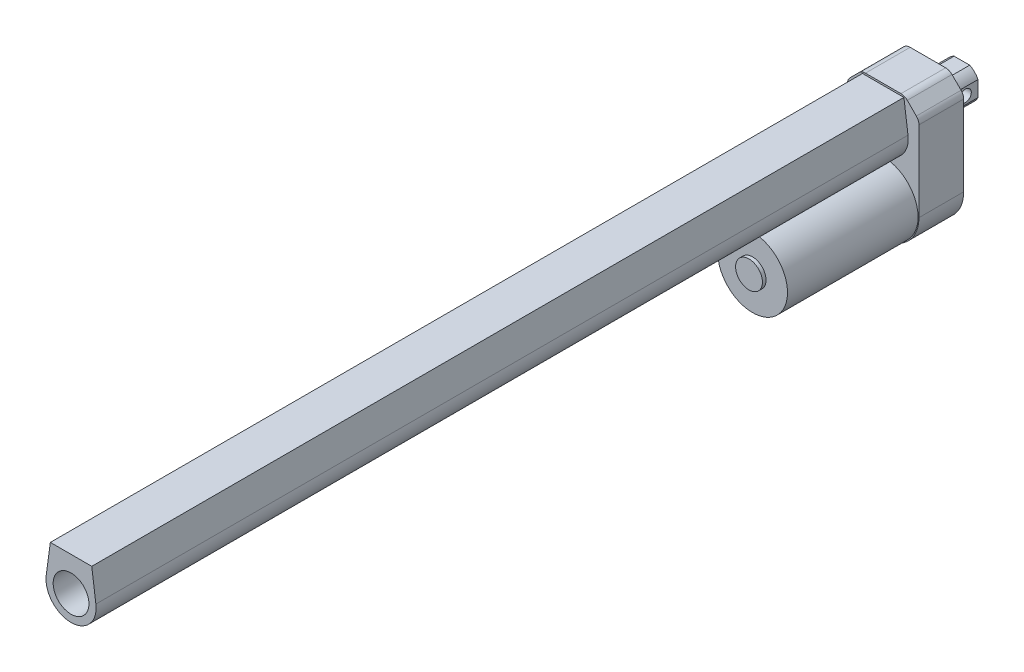
ISO-10303-21;
HEADER;
FILE_DESCRIPTION(('STEP AP214'),'2;1');
FILE_NAME('part.step','',(''),(''),'','','');
FILE_SCHEMA(('AUTOMOTIVE_DESIGN { 1 0 10303 214 1 1 1 1 }'));
ENDSEC;
DATA;
#1=APPLICATION_CONTEXT('core data for automotive mechanical design processes');
#2=APPLICATION_PROTOCOL_DEFINITION('international standard','automotive_design',2000,#1);
#3=PRODUCT_CONTEXT('',#1,'mechanical');
#4=PRODUCT('Part','Part','',(#3));
#5=PRODUCT_RELATED_PRODUCT_CATEGORY('part','',(#4));
#6=PRODUCT_DEFINITION_FORMATION('','',#4);
#7=PRODUCT_DEFINITION_CONTEXT('part definition',#1,'design');
#8=PRODUCT_DEFINITION('design','',#6,#7);
#9=PRODUCT_DEFINITION_SHAPE('','',#8);
#10=(LENGTH_UNIT() NAMED_UNIT(*) SI_UNIT(.MILLI.,.METRE.));
#11=(NAMED_UNIT(*) PLANE_ANGLE_UNIT() SI_UNIT($,.RADIAN.));
#12=(NAMED_UNIT(*) SI_UNIT($,.STERADIAN.) SOLID_ANGLE_UNIT());
#13=UNCERTAINTY_MEASURE_WITH_UNIT(LENGTH_MEASURE(1.E-05),#10,'distance_accuracy_value','');
#14=(GEOMETRIC_REPRESENTATION_CONTEXT(3) GLOBAL_UNCERTAINTY_ASSIGNED_CONTEXT((#13)) GLOBAL_UNIT_ASSIGNED_CONTEXT((#10,
#11,#12)) REPRESENTATION_CONTEXT('',''));
#15=CARTESIAN_POINT('',(0.,0.,0.));
#16=DIRECTION('',(0.,0.,1.));
#17=DIRECTION('',(1.,0.,0.));
#18=AXIS2_PLACEMENT_3D('',#15,#16,#17);
#19=CARTESIAN_POINT('',(0.,0.,0.));
#20=DIRECTION('',(0.,0.,1.));
#21=DIRECTION('',(1.,0.,0.));
#22=AXIS2_PLACEMENT_3D('',#19,#20,#21);
#23=PLANE('',#22);
#24=CARTESIAN_POINT('',(0.,0.,0.));
#25=DIRECTION('',(0.,0.,1.));
#26=DIRECTION('',(1.,0.,0.));
#27=AXIS2_PLACEMENT_3D('',#24,#25,#26);
#28=CIRCLE('',#27,20.);
#29=CARTESIAN_POINT('',(-20.,0.,0.));
#30=VERTEX_POINT('',#29);
#31=CARTESIAN_POINT('',(20.,0.,0.));
#32=VERTEX_POINT('',#31);
#33=EDGE_CURVE('E252',#30,#32,#28,.T.);
#34=ORIENTED_EDGE('',*,*,#33,.F.);
#35=DIRECTION('',(0.,-1.,0.));
#36=VECTOR('',#35,1.);
#37=CARTESIAN_POINT('',(-20.,0.,0.));
#38=LINE('',#37,#36);
#39=CARTESIAN_POINT('',(-20.,44.9289321881345,0.));
#40=VERTEX_POINT('',#39);
#41=EDGE_CURVE('E259',#40,#30,#38,.T.);
#42=ORIENTED_EDGE('',*,*,#41,.F.);
#43=CARTESIAN_POINT('',(-15.,44.9289321881345,0.));
#44=DIRECTION('',(0.,0.,1.));
#45=DIRECTION('',(-1.,0.,0.));
#46=AXIS2_PLACEMENT_3D('',#43,#44,#45);
#47=CIRCLE('',#46,5.);
#48=CARTESIAN_POINT('',(-18.5355339059327,48.4644660940673,0.));
#49=VERTEX_POINT('',#48);
#50=EDGE_CURVE('E294',#49,#40,#47,.T.);
#51=ORIENTED_EDGE('',*,*,#50,.F.);
#52=DIRECTION('',(-0.707106781186547,-0.707106781186548,0.));
#53=VECTOR('',#52,1.);
#54=CARTESIAN_POINT('',(-18.5355339059327,48.4644660940673,0.));
#55=LINE('',#54,#53);
#56=CARTESIAN_POINT('',(-13.4644660940673,53.5355339059327,0.));
#57=VERTEX_POINT('',#56);
#58=EDGE_CURVE('E292',#57,#49,#55,.T.);
#59=ORIENTED_EDGE('',*,*,#58,.F.);
#60=CARTESIAN_POINT('',(-9.92893218813452,50.,0.));
#61=DIRECTION('',(0.,0.,1.));
#62=DIRECTION('',(-1.,0.,0.));
#63=AXIS2_PLACEMENT_3D('',#60,#61,#62);
#64=CIRCLE('',#63,5.);
#65=CARTESIAN_POINT('',(-9.92893218813452,55.,0.));
#66=VERTEX_POINT('',#65);
#67=EDGE_CURVE('E290',#66,#57,#64,.T.);
#68=ORIENTED_EDGE('',*,*,#67,.F.);
#69=DIRECTION('',(-1.,0.,0.));
#70=VECTOR('',#69,1.);
#71=CARTESIAN_POINT('',(-9.92893218813452,55.,0.));
#72=LINE('',#71,#70);
#73=CARTESIAN_POINT('',(9.92893218813453,55.,0.));
#74=VERTEX_POINT('',#73);
#75=EDGE_CURVE('E288',#74,#66,#72,.T.);
#76=ORIENTED_EDGE('',*,*,#75,.F.);
#77=CARTESIAN_POINT('',(9.92893218813453,50.,0.));
#78=DIRECTION('',(0.,0.,1.));
#79=DIRECTION('',(1.,0.,0.));
#80=AXIS2_PLACEMENT_3D('',#77,#78,#79);
#81=CIRCLE('',#80,5.);
#82=CARTESIAN_POINT('',(13.4644660940673,53.5355339059327,0.));
#83=VERTEX_POINT('',#82);
#84=EDGE_CURVE('E286',#83,#74,#81,.T.);
#85=ORIENTED_EDGE('',*,*,#84,.F.);
#86=DIRECTION('',(-0.707106781186547,0.707106781186548,0.));
#87=VECTOR('',#86,1.);
#88=CARTESIAN_POINT('',(13.4644660940673,53.5355339059327,0.));
#89=LINE('',#88,#87);
#90=CARTESIAN_POINT('',(18.5355339059327,48.4644660940673,0.));
#91=VERTEX_POINT('',#90);
#92=EDGE_CURVE('E284',#91,#83,#89,.T.);
#93=ORIENTED_EDGE('',*,*,#92,.F.);
#94=CARTESIAN_POINT('',(15.,44.9289321881345,0.));
#95=DIRECTION('',(0.,0.,1.));
#96=DIRECTION('',(1.,0.,0.));
#97=AXIS2_PLACEMENT_3D('',#94,#95,#96);
#98=CIRCLE('',#97,5.);
#99=CARTESIAN_POINT('',(20.,44.9289321881345,0.));
#100=VERTEX_POINT('',#99);
#101=EDGE_CURVE('E282',#100,#91,#98,.T.);
#102=ORIENTED_EDGE('',*,*,#101,.F.);
#103=DIRECTION('',(0.,1.,0.));
#104=VECTOR('',#103,1.);
#105=CARTESIAN_POINT('',(20.,44.9289321881345,0.));
#106=LINE('',#105,#104);
#107=EDGE_CURVE('E280',#32,#100,#106,.T.);
#108=ORIENTED_EDGE('',*,*,#107,.F.);
#109=EDGE_LOOP('',(#34,#42,#51,#59,#68,#76,#85,#93,#102,#108));
#110=FACE_BOUND('',#109,.T.);
#111=CARTESIAN_POINT('',(0.,35.,0.));
#112=DIRECTION('',(0.,0.,-1.));
#113=DIRECTION('',(-1.,0.,0.));
#114=AXIS2_PLACEMENT_3D('',#111,#112,#113);
#115=CIRCLE('',#114,10.);
#116=CARTESIAN_POINT('',(9.00000000000001,30.6411010564594,0.));
#117=VERTEX_POINT('',#116);
#118=CARTESIAN_POINT('',(4.35889894354065,26.,0.));
#119=VERTEX_POINT('',#118);
#120=EDGE_CURVE('E205',#117,#119,#115,.T.);
#121=ORIENTED_EDGE('',*,*,#120,.F.);
#122=DIRECTION('',(0.,-1.,0.));
#123=VECTOR('',#122,1.);
#124=CARTESIAN_POINT('',(9.00000000000001,39.3588989435407,0.));
#125=LINE('',#124,#123);
#126=CARTESIAN_POINT('',(9.00000000000001,39.3588989435407,0.));
#127=VERTEX_POINT('',#126);
#128=EDGE_CURVE('E202',#127,#117,#125,.T.);
#129=ORIENTED_EDGE('',*,*,#128,.F.);
#130=CARTESIAN_POINT('',(0.,35.,0.));
#131=DIRECTION('',(0.,0.,-1.));
#132=DIRECTION('',(-1.,0.,0.));
#133=AXIS2_PLACEMENT_3D('',#130,#131,#132);
#134=CIRCLE('',#133,10.);
#135=CARTESIAN_POINT('',(4.3588989435407,44.,0.));
#136=VERTEX_POINT('',#135);
#137=EDGE_CURVE('E705',#136,#127,#134,.T.);
#138=ORIENTED_EDGE('',*,*,#137,.F.);
#139=DIRECTION('',(1.,0.,0.));
#140=VECTOR('',#139,1.);
#141=CARTESIAN_POINT('',(4.3588989435407,44.,0.));
#142=LINE('',#141,#140);
#143=CARTESIAN_POINT('',(-4.3588989435407,44.,0.));
#144=VERTEX_POINT('',#143);
#145=EDGE_CURVE('E702',#144,#136,#142,.T.);
#146=ORIENTED_EDGE('',*,*,#145,.F.);
#147=CARTESIAN_POINT('',(0.,35.,0.));
#148=DIRECTION('',(0.,0.,-1.));
#149=DIRECTION('',(-1.,0.,0.));
#150=AXIS2_PLACEMENT_3D('',#147,#148,#149);
#151=CIRCLE('',#150,10.);
#152=CARTESIAN_POINT('',(-9.,39.3588989435407,0.));
#153=VERTEX_POINT('',#152);
#154=EDGE_CURVE('E699',#153,#144,#151,.T.);
#155=ORIENTED_EDGE('',*,*,#154,.F.);
#156=DIRECTION('',(0.,1.,0.));
#157=VECTOR('',#156,1.);
#158=CARTESIAN_POINT('',(-9.,39.3588989435407,0.));
#159=LINE('',#158,#157);
#160=CARTESIAN_POINT('',(-9.00000000000001,30.6411010564594,0.));
#161=VERTEX_POINT('',#160);
#162=EDGE_CURVE('E696',#161,#153,#159,.T.);
#163=ORIENTED_EDGE('',*,*,#162,.F.);
#164=CARTESIAN_POINT('',(0.,35.,0.));
#165=DIRECTION('',(0.,0.,-1.));
#166=DIRECTION('',(-1.,0.,0.));
#167=AXIS2_PLACEMENT_3D('',#164,#165,#166);
#168=CIRCLE('',#167,10.);
#169=CARTESIAN_POINT('',(-4.35889894354066,26.,0.));
#170=VERTEX_POINT('',#169);
#171=EDGE_CURVE('E56',#170,#161,#168,.T.);
#172=ORIENTED_EDGE('',*,*,#171,.F.);
#173=DIRECTION('',(-1.,0.,0.));
#174=VECTOR('',#173,1.);
#175=CARTESIAN_POINT('',(4.35889894354065,26.,0.));
#176=LINE('',#175,#174);
#177=EDGE_CURVE('E51',#119,#170,#176,.T.);
#178=ORIENTED_EDGE('',*,*,#177,.F.);
#179=EDGE_LOOP('',(#121,#129,#138,#146,#155,#163,#172,#178));
#180=FACE_BOUND('',#179,.T.);
#181=ADVANCED_FACE('F34',(#110,#180),#23,.F.);
#182=CARTESIAN_POINT('',(0.,0.,25.));
#183=DIRECTION('',(0.,0.,1.));
#184=DIRECTION('',(1.,0.,0.));
#185=AXIS2_PLACEMENT_3D('',#182,#183,#184);
#186=PLANE('',#185);
#187=CARTESIAN_POINT('',(0.,0.,25.));
#188=DIRECTION('',(0.,0.,1.));
#189=DIRECTION('',(1.,0.,0.));
#190=AXIS2_PLACEMENT_3D('',#187,#188,#189);
#191=CIRCLE('',#190,19.5);
#192=CARTESIAN_POINT('',(19.5,0.,25.));
#193=VERTEX_POINT('',#192);
#194=EDGE_CURVE('E43',#193,#193,#191,.T.);
#195=ORIENTED_EDGE('',*,*,#194,.F.);
#196=EDGE_LOOP('',(#195));
#197=FACE_BOUND('',#196,.T.);
#198=CARTESIAN_POINT('',(0.,0.,25.));
#199=DIRECTION('',(0.,0.,1.));
#200=DIRECTION('',(1.,0.,0.));
#201=AXIS2_PLACEMENT_3D('',#198,#199,#200);
#202=CIRCLE('',#201,20.);
#203=CARTESIAN_POINT('',(-20.,0.,25.));
#204=VERTEX_POINT('',#203);
#205=CARTESIAN_POINT('',(20.,0.,25.));
#206=VERTEX_POINT('',#205);
#207=EDGE_CURVE('E255',#204,#206,#202,.T.);
#208=ORIENTED_EDGE('',*,*,#207,.T.);
#209=DIRECTION('',(0.,1.,0.));
#210=VECTOR('',#209,1.);
#211=CARTESIAN_POINT('',(20.,44.9289321881345,25.));
#212=LINE('',#211,#210);
#213=CARTESIAN_POINT('',(20.,44.9289321881345,25.));
#214=VERTEX_POINT('',#213);
#215=EDGE_CURVE('E258',#206,#214,#212,.T.);
#216=ORIENTED_EDGE('',*,*,#215,.T.);
#217=CARTESIAN_POINT('',(15.,44.9289321881345,25.));
#218=DIRECTION('',(0.,0.,1.));
#219=DIRECTION('',(1.,0.,0.));
#220=AXIS2_PLACEMENT_3D('',#217,#218,#219);
#221=CIRCLE('',#220,5.);
#222=CARTESIAN_POINT('',(18.5355339059327,48.4644660940673,25.));
#223=VERTEX_POINT('',#222);
#224=EDGE_CURVE('E261',#214,#223,#221,.T.);
#225=ORIENTED_EDGE('',*,*,#224,.T.);
#226=DIRECTION('',(-0.707106781186547,0.707106781186548,0.));
#227=VECTOR('',#226,1.);
#228=CARTESIAN_POINT('',(13.4644660940673,53.5355339059327,25.));
#229=LINE('',#228,#227);
#230=CARTESIAN_POINT('',(13.4644660940673,53.5355339059327,25.));
#231=VERTEX_POINT('',#230);
#232=EDGE_CURVE('E263',#223,#231,#229,.T.);
#233=ORIENTED_EDGE('',*,*,#232,.T.);
#234=CARTESIAN_POINT('',(9.92893218813453,50.,25.));
#235=DIRECTION('',(0.,0.,1.));
#236=DIRECTION('',(1.,0.,0.));
#237=AXIS2_PLACEMENT_3D('',#234,#235,#236);
#238=CIRCLE('',#237,5.);
#239=CARTESIAN_POINT('',(9.92893218813453,55.,25.));
#240=VERTEX_POINT('',#239);
#241=EDGE_CURVE('E265',#231,#240,#238,.T.);
#242=ORIENTED_EDGE('',*,*,#241,.T.);
#243=DIRECTION('',(-1.,0.,0.));
#244=VECTOR('',#243,1.);
#245=CARTESIAN_POINT('',(-9.92893218813452,55.,25.));
#246=LINE('',#245,#244);
#247=CARTESIAN_POINT('',(-9.92893218813452,55.,25.));
#248=VERTEX_POINT('',#247);
#249=EDGE_CURVE('E267',#240,#248,#246,.T.);
#250=ORIENTED_EDGE('',*,*,#249,.T.);
#251=CARTESIAN_POINT('',(-9.92893218813452,50.,25.));
#252=DIRECTION('',(0.,0.,1.));
#253=DIRECTION('',(-1.,0.,0.));
#254=AXIS2_PLACEMENT_3D('',#251,#252,#253);
#255=CIRCLE('',#254,5.);
#256=CARTESIAN_POINT('',(-13.4644660940673,53.5355339059327,25.));
#257=VERTEX_POINT('',#256);
#258=EDGE_CURVE('E269',#248,#257,#255,.T.);
#259=ORIENTED_EDGE('',*,*,#258,.T.);
#260=DIRECTION('',(-0.707106781186547,-0.707106781186548,0.));
#261=VECTOR('',#260,1.);
#262=CARTESIAN_POINT('',(-18.5355339059327,48.4644660940673,25.));
#263=LINE('',#262,#261);
#264=CARTESIAN_POINT('',(-18.5355339059327,48.4644660940673,25.));
#265=VERTEX_POINT('',#264);
#266=EDGE_CURVE('E271',#257,#265,#263,.T.);
#267=ORIENTED_EDGE('',*,*,#266,.T.);
#268=CARTESIAN_POINT('',(-15.,44.9289321881345,25.));
#269=DIRECTION('',(0.,0.,1.));
#270=DIRECTION('',(-1.,0.,0.));
#271=AXIS2_PLACEMENT_3D('',#268,#269,#270);
#272=CIRCLE('',#271,5.);
#273=CARTESIAN_POINT('',(-20.,44.9289321881345,25.));
#274=VERTEX_POINT('',#273);
#275=EDGE_CURVE('E273',#265,#274,#272,.T.);
#276=ORIENTED_EDGE('',*,*,#275,.T.);
#277=DIRECTION('',(0.,-1.,0.));
#278=VECTOR('',#277,1.);
#279=CARTESIAN_POINT('',(-20.,0.,25.));
#280=LINE('',#279,#278);
#281=EDGE_CURVE('E275',#274,#204,#280,.T.);
#282=ORIENTED_EDGE('',*,*,#281,.T.);
#283=EDGE_LOOP('',(#208,#216,#225,#233,#242,#250,#259,#267,#276,#282));
#284=FACE_BOUND('',#283,.T.);
#285=DIRECTION('',(-0.13296122052609,-0.991121240735064,0.));
#286=VECTOR('',#285,1.);
#287=CARTESIAN_POINT('',(-11.5765219616268,54.,25.));
#288=LINE('',#287,#286);
#289=CARTESIAN_POINT('',(-11.5765219616268,54.,25.));
#290=VERTEX_POINT('',#289);
#291=CARTESIAN_POINT('',(-13.8756973702909,36.8614570873653,25.));
#292=VERTEX_POINT('',#291);
#293=EDGE_CURVE('E231',#290,#292,#288,.T.);
#294=ORIENTED_EDGE('',*,*,#293,.F.);
#295=DIRECTION('',(-1.,0.,0.));
#296=VECTOR('',#295,1.);
#297=CARTESIAN_POINT('',(-11.5765219616268,54.,25.));
#298=LINE('',#297,#296);
#299=CARTESIAN_POINT('',(11.5765219616268,54.,25.));
#300=VERTEX_POINT('',#299);
#301=EDGE_CURVE('E216',#300,#290,#298,.T.);
#302=ORIENTED_EDGE('',*,*,#301,.F.);
#303=DIRECTION('',(-0.13296122052609,0.991121240735064,0.));
#304=VECTOR('',#303,1.);
#305=CARTESIAN_POINT('',(11.5765219616268,54.,25.));
#306=LINE('',#305,#304);
#307=CARTESIAN_POINT('',(13.8756973702909,36.8614570873653,25.));
#308=VERTEX_POINT('',#307);
#309=EDGE_CURVE('E222',#308,#300,#306,.T.);
#310=ORIENTED_EDGE('',*,*,#309,.F.);
#311=CARTESIAN_POINT('',(0.,35.,25.));
#312=DIRECTION('',(0.,0.,1.));
#313=DIRECTION('',(1.,0.,0.));
#314=AXIS2_PLACEMENT_3D('',#311,#312,#313);
#315=CIRCLE('',#314,14.);
#316=EDGE_CURVE('E233',#292,#308,#315,.T.);
#317=ORIENTED_EDGE('',*,*,#316,.F.);
#318=EDGE_LOOP('',(#294,#302,#310,#317));
#319=FACE_BOUND('',#318,.T.);
#320=ADVANCED_FACE('F346',(#197,#284,#319),#186,.T.);
#321=CARTESIAN_POINT('',(0.,0.,25.));
#322=DIRECTION('',(0.,0.,-1.));
#323=DIRECTION('',(-1.,0.,0.));
#324=AXIS2_PLACEMENT_3D('',#321,#322,#323);
#325=CYLINDRICAL_SURFACE('',#324,20.);
#326=ORIENTED_EDGE('',*,*,#33,.T.);
#327=DIRECTION('',(0.,0.,-1.));
#328=VECTOR('',#327,1.);
#329=CARTESIAN_POINT('',(20.,0.,25.));
#330=LINE('',#329,#328);
#331=EDGE_CURVE('E38',#206,#32,#330,.T.);
#332=ORIENTED_EDGE('',*,*,#331,.F.);
#333=ORIENTED_EDGE('',*,*,#207,.F.);
#334=DIRECTION('',(0.,0.,-1.));
#335=VECTOR('',#334,1.);
#336=CARTESIAN_POINT('',(-20.,0.,25.));
#337=LINE('',#336,#335);
#338=EDGE_CURVE('E277',#204,#30,#337,.T.);
#339=ORIENTED_EDGE('',*,*,#338,.T.);
#340=EDGE_LOOP('',(#326,#332,#333,#339));
#341=FACE_BOUND('',#340,.T.);
#342=ADVANCED_FACE('F36',(#341),#325,.T.);
#343=CARTESIAN_POINT('',(20.,44.9289321881345,25.));
#344=DIRECTION('',(-1.,0.,0.));
#345=DIRECTION('',(0.,-1.,0.));
#346=AXIS2_PLACEMENT_3D('',#343,#344,#345);
#347=PLANE('',#346);
#348=ORIENTED_EDGE('',*,*,#107,.T.);
#349=DIRECTION('',(0.,0.,-1.));
#350=VECTOR('',#349,1.);
#351=CARTESIAN_POINT('',(20.,44.9289321881345,25.));
#352=LINE('',#351,#350);
#353=EDGE_CURVE('E319',#214,#100,#352,.T.);
#354=ORIENTED_EDGE('',*,*,#353,.F.);
#355=ORIENTED_EDGE('',*,*,#215,.F.);
#356=ORIENTED_EDGE('',*,*,#331,.T.);
#357=EDGE_LOOP('',(#348,#354,#355,#356));
#358=FACE_BOUND('',#357,.T.);
#359=ADVANCED_FACE('F328',(#358),#347,.F.);
#360=CARTESIAN_POINT('',(15.,44.9289321881345,25.));
#361=DIRECTION('',(0.,0.,-1.));
#362=DIRECTION('',(-1.,0.,0.));
#363=AXIS2_PLACEMENT_3D('',#360,#361,#362);
#364=CYLINDRICAL_SURFACE('',#363,5.);
#365=ORIENTED_EDGE('',*,*,#101,.T.);
#366=DIRECTION('',(0.,0.,-1.));
#367=VECTOR('',#366,1.);
#368=CARTESIAN_POINT('',(18.5355339059327,48.4644660940673,25.));
#369=LINE('',#368,#367);
#370=EDGE_CURVE('E317',#223,#91,#369,.T.);
#371=ORIENTED_EDGE('',*,*,#370,.F.);
#372=ORIENTED_EDGE('',*,*,#224,.F.);
#373=ORIENTED_EDGE('',*,*,#353,.T.);
#374=EDGE_LOOP('',(#365,#371,#372,#373));
#375=FACE_BOUND('',#374,.T.);
#376=ADVANCED_FACE('F339',(#375),#364,.T.);
#377=CARTESIAN_POINT('',(13.4644660940673,53.5355339059327,25.));
#378=DIRECTION('',(-0.707106781186548,-0.707106781186547,0.));
#379=DIRECTION('',(0.707106781186547,-0.707106781186548,0.));
#380=AXIS2_PLACEMENT_3D('',#377,#378,#379);
#381=PLANE('',#380);
#382=ORIENTED_EDGE('',*,*,#92,.T.);
#383=DIRECTION('',(0.,0.,-1.));
#384=VECTOR('',#383,1.);
#385=CARTESIAN_POINT('',(13.4644660940673,53.5355339059327,25.));
#386=LINE('',#385,#384);
#387=EDGE_CURVE('E314',#231,#83,#386,.T.);
#388=ORIENTED_EDGE('',*,*,#387,.F.);
#389=ORIENTED_EDGE('',*,*,#232,.F.);
#390=ORIENTED_EDGE('',*,*,#370,.T.);
#391=EDGE_LOOP('',(#382,#388,#389,#390));
#392=FACE_BOUND('',#391,.T.);
#393=ADVANCED_FACE('F342',(#392),#381,.F.);
#394=CARTESIAN_POINT('',(9.92893218813453,50.,25.));
#395=DIRECTION('',(0.,0.,-1.));
#396=DIRECTION('',(-1.,0.,0.));
#397=AXIS2_PLACEMENT_3D('',#394,#395,#396);
#398=CYLINDRICAL_SURFACE('',#397,5.);
#399=ORIENTED_EDGE('',*,*,#84,.T.);
#400=DIRECTION('',(0.,0.,-1.));
#401=VECTOR('',#400,1.);
#402=CARTESIAN_POINT('',(9.92893218813453,55.,25.));
#403=LINE('',#402,#401);
#404=EDGE_CURVE('E311',#240,#74,#403,.T.);
#405=ORIENTED_EDGE('',*,*,#404,.F.);
#406=ORIENTED_EDGE('',*,*,#241,.F.);
#407=ORIENTED_EDGE('',*,*,#387,.T.);
#408=EDGE_LOOP('',(#399,#405,#406,#407));
#409=FACE_BOUND('',#408,.T.);
#410=ADVANCED_FACE('F372',(#409),#398,.T.);
#411=CARTESIAN_POINT('',(-9.92893218813452,55.,25.));
#412=DIRECTION('',(0.,-1.,0.));
#413=DIRECTION('',(0.,0.,-1.));
#414=AXIS2_PLACEMENT_3D('',#411,#412,#413);
#415=PLANE('',#414);
#416=ORIENTED_EDGE('',*,*,#75,.T.);
#417=DIRECTION('',(0.,0.,-1.));
#418=VECTOR('',#417,1.);
#419=CARTESIAN_POINT('',(-9.92893218813452,55.,25.));
#420=LINE('',#419,#418);
#421=EDGE_CURVE('E308',#248,#66,#420,.T.);
#422=ORIENTED_EDGE('',*,*,#421,.F.);
#423=ORIENTED_EDGE('',*,*,#249,.F.);
#424=ORIENTED_EDGE('',*,*,#404,.T.);
#425=EDGE_LOOP('',(#416,#422,#423,#424));
#426=FACE_BOUND('',#425,.T.);
#427=ADVANCED_FACE('F370',(#426),#415,.F.);
#428=CARTESIAN_POINT('',(-9.92893218813452,50.,25.));
#429=DIRECTION('',(0.,0.,-1.));
#430=DIRECTION('',(-1.,0.,0.));
#431=AXIS2_PLACEMENT_3D('',#428,#429,#430);
#432=CYLINDRICAL_SURFACE('',#431,5.);
#433=ORIENTED_EDGE('',*,*,#67,.T.);
#434=DIRECTION('',(0.,0.,-1.));
#435=VECTOR('',#434,1.);
#436=CARTESIAN_POINT('',(-13.4644660940673,53.5355339059327,25.));
#437=LINE('',#436,#435);
#438=EDGE_CURVE('E305',#257,#57,#437,.T.);
#439=ORIENTED_EDGE('',*,*,#438,.F.);
#440=ORIENTED_EDGE('',*,*,#258,.F.);
#441=ORIENTED_EDGE('',*,*,#421,.T.);
#442=EDGE_LOOP('',(#433,#439,#440,#441));
#443=FACE_BOUND('',#442,.T.);
#444=ADVANCED_FACE('F366',(#443),#432,.T.);
#445=CARTESIAN_POINT('',(-18.5355339059327,48.4644660940673,25.));
#446=DIRECTION('',(0.707106781186548,-0.707106781186547,0.));
#447=DIRECTION('',(0.707106781186547,0.707106781186548,0.));
#448=AXIS2_PLACEMENT_3D('',#445,#446,#447);
#449=PLANE('',#448);
#450=ORIENTED_EDGE('',*,*,#58,.T.);
#451=DIRECTION('',(0.,0.,-1.));
#452=VECTOR('',#451,1.);
#453=CARTESIAN_POINT('',(-18.5355339059327,48.4644660940673,25.));
#454=LINE('',#453,#452);
#455=EDGE_CURVE('E302',#265,#49,#454,.T.);
#456=ORIENTED_EDGE('',*,*,#455,.F.);
#457=ORIENTED_EDGE('',*,*,#266,.F.);
#458=ORIENTED_EDGE('',*,*,#438,.T.);
#459=EDGE_LOOP('',(#450,#456,#457,#458));
#460=FACE_BOUND('',#459,.T.);
#461=ADVANCED_FACE('F361',(#460),#449,.F.);
#462=CARTESIAN_POINT('',(-15.,44.9289321881345,25.));
#463=DIRECTION('',(0.,0.,-1.));
#464=DIRECTION('',(-1.,0.,0.));
#465=AXIS2_PLACEMENT_3D('',#462,#463,#464);
#466=CYLINDRICAL_SURFACE('',#465,5.);
#467=ORIENTED_EDGE('',*,*,#50,.T.);
#468=DIRECTION('',(0.,0.,-1.));
#469=VECTOR('',#468,1.);
#470=CARTESIAN_POINT('',(-20.,44.9289321881345,25.));
#471=LINE('',#470,#469);
#472=EDGE_CURVE('E299',#274,#40,#471,.T.);
#473=ORIENTED_EDGE('',*,*,#472,.F.);
#474=ORIENTED_EDGE('',*,*,#275,.F.);
#475=ORIENTED_EDGE('',*,*,#455,.T.);
#476=EDGE_LOOP('',(#467,#473,#474,#475));
#477=FACE_BOUND('',#476,.T.);
#478=ADVANCED_FACE('F355',(#477),#466,.T.);
#479=CARTESIAN_POINT('',(-20.,0.,25.));
#480=DIRECTION('',(1.,0.,0.));
#481=DIRECTION('',(0.,0.,-1.));
#482=AXIS2_PLACEMENT_3D('',#479,#480,#481);
#483=PLANE('',#482);
#484=ORIENTED_EDGE('',*,*,#41,.T.);
#485=ORIENTED_EDGE('',*,*,#338,.F.);
#486=ORIENTED_EDGE('',*,*,#281,.F.);
#487=ORIENTED_EDGE('',*,*,#472,.T.);
#488=EDGE_LOOP('',(#484,#485,#486,#487));
#489=FACE_BOUND('',#488,.T.);
#490=ADVANCED_FACE('F353',(#489),#483,.F.);
#491=CARTESIAN_POINT('',(0.,0.,98.));
#492=DIRECTION('',(0.,0.,-1.));
#493=DIRECTION('',(-1.,0.,0.));
#494=AXIS2_PLACEMENT_3D('',#491,#492,#493);
#495=CYLINDRICAL_SURFACE('',#494,19.5);
#496=CARTESIAN_POINT('',(0.,0.,98.));
#497=DIRECTION('',(0.,0.,1.));
#498=DIRECTION('',(1.,0.,0.));
#499=AXIS2_PLACEMENT_3D('',#496,#497,#498);
#500=CIRCLE('',#499,19.5);
#501=CARTESIAN_POINT('',(19.5,0.,98.));
#502=VERTEX_POINT('',#501);
#503=EDGE_CURVE('E248',#502,#502,#500,.T.);
#504=ORIENTED_EDGE('',*,*,#503,.F.);
#505=EDGE_LOOP('',(#504));
#506=FACE_BOUND('',#505,.T.);
#507=ORIENTED_EDGE('',*,*,#194,.T.);
#508=EDGE_LOOP('',(#507));
#509=FACE_BOUND('',#508,.T.);
#510=ADVANCED_FACE('F392',(#506,#509),#495,.T.);
#511=CARTESIAN_POINT('',(0.,0.,98.));
#512=DIRECTION('',(0.,0.,1.));
#513=DIRECTION('',(1.,0.,0.));
#514=AXIS2_PLACEMENT_3D('',#511,#512,#513);
#515=PLANE('',#514);
#516=CARTESIAN_POINT('',(0.,0.,98.));
#517=DIRECTION('',(0.,0.,1.));
#518=DIRECTION('',(1.,0.,0.));
#519=AXIS2_PLACEMENT_3D('',#516,#517,#518);
#520=CIRCLE('',#519,7.5);
#521=CARTESIAN_POINT('',(7.5,0.,98.));
#522=VERTEX_POINT('',#521);
#523=EDGE_CURVE('E11',#522,#522,#520,.T.);
#524=ORIENTED_EDGE('',*,*,#523,.F.);
#525=EDGE_LOOP('',(#524));
#526=FACE_BOUND('',#525,.T.);
#527=ORIENTED_EDGE('',*,*,#503,.T.);
#528=EDGE_LOOP('',(#527));
#529=FACE_BOUND('',#528,.T.);
#530=ADVANCED_FACE('F420',(#526,#529),#515,.T.);
#531=CARTESIAN_POINT('',(0.,0.,100.));
#532=DIRECTION('',(0.,0.,-1.));
#533=DIRECTION('',(-1.,0.,0.));
#534=AXIS2_PLACEMENT_3D('',#531,#532,#533);
#535=CYLINDRICAL_SURFACE('',#534,7.5);
#536=CARTESIAN_POINT('',(0.,0.,100.));
#537=DIRECTION('',(0.,0.,1.));
#538=DIRECTION('',(1.,0.,0.));
#539=AXIS2_PLACEMENT_3D('',#536,#537,#538);
#540=CIRCLE('',#539,7.5);
#541=CARTESIAN_POINT('',(7.5,0.,100.));
#542=VERTEX_POINT('',#541);
#543=EDGE_CURVE('E246',#542,#542,#540,.T.);
#544=ORIENTED_EDGE('',*,*,#543,.F.);
#545=EDGE_LOOP('',(#544));
#546=FACE_BOUND('',#545,.T.);
#547=ORIENTED_EDGE('',*,*,#523,.T.);
#548=EDGE_LOOP('',(#547));
#549=FACE_BOUND('',#548,.T.);
#550=ADVANCED_FACE('F427',(#546,#549),#535,.T.);
#551=CARTESIAN_POINT('',(0.,0.,100.));
#552=DIRECTION('',(0.,0.,1.));
#553=DIRECTION('',(1.,0.,0.));
#554=AXIS2_PLACEMENT_3D('',#551,#552,#553);
#555=PLANE('',#554);
#556=ORIENTED_EDGE('',*,*,#543,.T.);
#557=EDGE_LOOP('',(#556));
#558=FACE_BOUND('',#557,.T.);
#559=ADVANCED_FACE('F435',(#558),#555,.T.);
#560=CARTESIAN_POINT('',(-11.5765219616268,54.,479.));
#561=DIRECTION('',(0.,-1.,0.));
#562=DIRECTION('',(0.,0.,-1.));
#563=AXIS2_PLACEMENT_3D('',#560,#561,#562);
#564=PLANE('',#563);
#565=ORIENTED_EDGE('',*,*,#301,.T.);
#566=DIRECTION('',(0.,0.,-1.));
#567=VECTOR('',#566,1.);
#568=CARTESIAN_POINT('',(-11.5765219616268,54.,479.));
#569=LINE('',#568,#567);
#570=CARTESIAN_POINT('',(-11.5765219616268,54.,479.));
#571=VERTEX_POINT('',#570);
#572=EDGE_CURVE('E244',#571,#290,#569,.T.);
#573=ORIENTED_EDGE('',*,*,#572,.F.);
#574=DIRECTION('',(-1.,0.,0.));
#575=VECTOR('',#574,1.);
#576=CARTESIAN_POINT('',(-11.5765219616268,54.,479.));
#577=LINE('',#576,#575);
#578=CARTESIAN_POINT('',(11.5765219616268,54.,479.));
#579=VERTEX_POINT('',#578);
#580=EDGE_CURVE('E218',#579,#571,#577,.T.);
#581=ORIENTED_EDGE('',*,*,#580,.F.);
#582=DIRECTION('',(0.,0.,-1.));
#583=VECTOR('',#582,1.);
#584=CARTESIAN_POINT('',(11.5765219616268,54.,479.));
#585=LINE('',#584,#583);
#586=EDGE_CURVE('E228',#579,#300,#585,.T.);
#587=ORIENTED_EDGE('',*,*,#586,.T.);
#588=EDGE_LOOP('',(#565,#573,#581,#587));
#589=FACE_BOUND('',#588,.T.);
#590=ADVANCED_FACE('F443',(#589),#564,.F.);
#591=CARTESIAN_POINT('',(-11.5765219616268,54.,479.));
#592=DIRECTION('',(0.991121240735064,-0.13296122052609,0.));
#593=DIRECTION('',(0.13296122052609,0.991121240735064,0.));
#594=AXIS2_PLACEMENT_3D('',#591,#592,#593);
#595=PLANE('',#594);
#596=ORIENTED_EDGE('',*,*,#293,.T.);
#597=DIRECTION('',(0.,0.,-1.));
#598=VECTOR('',#597,1.);
#599=CARTESIAN_POINT('',(-13.8756973702909,36.8614570873653,479.));
#600=LINE('',#599,#598);
#601=CARTESIAN_POINT('',(-13.8756973702909,36.8614570873653,479.));
#602=VERTEX_POINT('',#601);
#603=EDGE_CURVE('E241',#602,#292,#600,.T.);
#604=ORIENTED_EDGE('',*,*,#603,.F.);
#605=DIRECTION('',(-0.13296122052609,-0.991121240735064,0.));
#606=VECTOR('',#605,1.);
#607=CARTESIAN_POINT('',(-11.5765219616268,54.,479.));
#608=LINE('',#607,#606);
#609=EDGE_CURVE('E221',#571,#602,#608,.T.);
#610=ORIENTED_EDGE('',*,*,#609,.F.);
#611=ORIENTED_EDGE('',*,*,#572,.T.);
#612=EDGE_LOOP('',(#596,#604,#610,#611));
#613=FACE_BOUND('',#612,.T.);
#614=ADVANCED_FACE('F452',(#613),#595,.F.);
#615=CARTESIAN_POINT('',(0.,35.,479.));
#616=DIRECTION('',(0.,0.,-1.));
#617=DIRECTION('',(-1.,0.,0.));
#618=AXIS2_PLACEMENT_3D('',#615,#616,#617);
#619=CYLINDRICAL_SURFACE('',#618,14.);
#620=ORIENTED_EDGE('',*,*,#316,.T.);
#621=DIRECTION('',(0.,0.,-1.));
#622=VECTOR('',#621,1.);
#623=CARTESIAN_POINT('',(13.8756973702909,36.8614570873653,479.));
#624=LINE('',#623,#622);
#625=CARTESIAN_POINT('',(13.8756973702909,36.8614570873653,479.));
#626=VERTEX_POINT('',#625);
#627=EDGE_CURVE('E239',#626,#308,#624,.T.);
#628=ORIENTED_EDGE('',*,*,#627,.F.);
#629=CARTESIAN_POINT('',(0.,35.,479.));
#630=DIRECTION('',(0.,0.,1.));
#631=DIRECTION('',(1.,0.,0.));
#632=AXIS2_PLACEMENT_3D('',#629,#630,#631);
#633=CIRCLE('',#632,14.);
#634=EDGE_CURVE('E224',#602,#626,#633,.T.);
#635=ORIENTED_EDGE('',*,*,#634,.F.);
#636=ORIENTED_EDGE('',*,*,#603,.T.);
#637=EDGE_LOOP('',(#620,#628,#635,#636));
#638=FACE_BOUND('',#637,.T.);
#639=ADVANCED_FACE('F460',(#638),#619,.T.);
#640=CARTESIAN_POINT('',(11.5765219616268,54.,479.));
#641=DIRECTION('',(-0.991121240735064,-0.13296122052609,0.));
#642=DIRECTION('',(0.13296122052609,-0.991121240735064,0.));
#643=AXIS2_PLACEMENT_3D('',#640,#641,#642);
#644=PLANE('',#643);
#645=ORIENTED_EDGE('',*,*,#309,.T.);
#646=ORIENTED_EDGE('',*,*,#586,.F.);
#647=DIRECTION('',(-0.13296122052609,0.991121240735064,0.));
#648=VECTOR('',#647,1.);
#649=CARTESIAN_POINT('',(11.5765219616268,54.,479.));
#650=LINE('',#649,#648);
#651=EDGE_CURVE('E226',#626,#579,#650,.T.);
#652=ORIENTED_EDGE('',*,*,#651,.F.);
#653=ORIENTED_EDGE('',*,*,#627,.T.);
#654=EDGE_LOOP('',(#645,#646,#652,#653));
#655=FACE_BOUND('',#654,.T.);
#656=ADVANCED_FACE('F468',(#655),#644,.F.);
#657=CARTESIAN_POINT('',(0.,35.,479.));
#658=DIRECTION('',(0.,0.,1.));
#659=DIRECTION('',(1.,0.,0.));
#660=AXIS2_PLACEMENT_3D('',#657,#658,#659);
#661=PLANE('',#660);
#662=CARTESIAN_POINT('',(0.,35.,479.));
#663=DIRECTION('',(0.,0.,1.));
#664=DIRECTION('',(1.,0.,0.));
#665=AXIS2_PLACEMENT_3D('',#662,#663,#664);
#666=CIRCLE('',#665,10.);
#667=CARTESIAN_POINT('',(10.,35.,479.));
#668=VERTEX_POINT('',#667);
#669=EDGE_CURVE('E206',#668,#668,#666,.T.);
#670=ORIENTED_EDGE('',*,*,#669,.F.);
#671=EDGE_LOOP('',(#670));
#672=FACE_BOUND('',#671,.T.);
#673=ORIENTED_EDGE('',*,*,#580,.T.);
#674=ORIENTED_EDGE('',*,*,#609,.T.);
#675=ORIENTED_EDGE('',*,*,#634,.T.);
#676=ORIENTED_EDGE('',*,*,#651,.T.);
#677=EDGE_LOOP('',(#673,#674,#675,#676));
#678=FACE_BOUND('',#677,.T.);
#679=ADVANCED_FACE('F476',(#672,#678),#661,.T.);
#680=CARTESIAN_POINT('',(0.,35.,69.0000000000001));
#681=DIRECTION('',(0.,0.,1.));
#682=DIRECTION('',(1.,0.,0.));
#683=AXIS2_PLACEMENT_3D('',#680,#681,#682);
#684=CYLINDRICAL_SURFACE('',#683,10.);
#685=CARTESIAN_POINT('',(0.,35.,69.0000000000001));
#686=DIRECTION('',(0.,0.,1.));
#687=DIRECTION('',(1.,0.,0.));
#688=AXIS2_PLACEMENT_3D('',#685,#686,#687);
#689=CIRCLE('',#688,10.);
#690=CARTESIAN_POINT('',(10.,35.,69.0000000000001));
#691=VERTEX_POINT('',#690);
#692=EDGE_CURVE('E209',#691,#691,#689,.T.);
#693=ORIENTED_EDGE('',*,*,#692,.F.);
#694=EDGE_LOOP('',(#693));
#695=FACE_BOUND('',#694,.T.);
#696=ORIENTED_EDGE('',*,*,#669,.T.);
#697=EDGE_LOOP('',(#696));
#698=FACE_BOUND('',#697,.T.);
#699=ADVANCED_FACE('F484',(#695,#698),#684,.F.);
#700=CARTESIAN_POINT('',(0.,35.,69.0000000000001));
#701=DIRECTION('',(0.,0.,1.));
#702=DIRECTION('',(1.,0.,0.));
#703=AXIS2_PLACEMENT_3D('',#700,#701,#702);
#704=PLANE('',#703);
#705=ORIENTED_EDGE('',*,*,#692,.T.);
#706=EDGE_LOOP('',(#705));
#707=FACE_BOUND('',#706,.T.);
#708=ADVANCED_FACE('F492',(#707),#704,.T.);
#709=CARTESIAN_POINT('',(0.,35.,-19.));
#710=DIRECTION('',(0.,0.,1.));
#711=DIRECTION('',(1.,0.,0.));
#712=AXIS2_PLACEMENT_3D('',#709,#710,#711);
#713=CYLINDRICAL_SURFACE('',#712,10.);
#714=ORIENTED_EDGE('',*,*,#120,.T.);
#715=DIRECTION('',(0.,0.,1.));
#716=VECTOR('',#715,1.);
#717=CARTESIAN_POINT('',(4.35889894354065,26.,-19.));
#718=LINE('',#717,#716);
#719=CARTESIAN_POINT('',(4.35889894354065,26.,-19.));
#720=VERTEX_POINT('',#719);
#721=EDGE_CURVE('E186',#720,#119,#718,.T.);
#722=ORIENTED_EDGE('',*,*,#721,.F.);
#723=CARTESIAN_POINT('',(0.,35.,-19.));
#724=DIRECTION('',(0.,0.,-1.));
#725=DIRECTION('',(-1.,0.,0.));
#726=AXIS2_PLACEMENT_3D('',#723,#724,#725);
#727=CIRCLE('',#726,10.);
#728=CARTESIAN_POINT('',(9.00000000000001,30.6411010564594,-19.));
#729=VERTEX_POINT('',#728);
#730=EDGE_CURVE('E193',#729,#720,#727,.T.);
#731=ORIENTED_EDGE('',*,*,#730,.F.);
#732=DIRECTION('',(0.,0.,1.));
#733=VECTOR('',#732,1.);
#734=CARTESIAN_POINT('',(9.00000000000001,30.6411010564594,-19.));
#735=LINE('',#734,#733);
#736=EDGE_CURVE('E692',#729,#117,#735,.T.);
#737=ORIENTED_EDGE('',*,*,#736,.T.);
#738=EDGE_LOOP('',(#714,#722,#731,#737));
#739=FACE_BOUND('',#738,.T.);
#740=ADVANCED_FACE('F204',(#739),#713,.T.);
#741=CARTESIAN_POINT('',(4.35889894354065,26.,-19.));
#742=DIRECTION('',(0.,1.,0.));
#743=DIRECTION('',(0.,0.,1.));
#744=AXIS2_PLACEMENT_3D('',#741,#742,#743);
#745=PLANE('',#744);
#746=ORIENTED_EDGE('',*,*,#177,.T.);
#747=DIRECTION('',(0.,0.,1.));
#748=VECTOR('',#747,1.);
#749=CARTESIAN_POINT('',(-4.35889894354066,26.,-19.));
#750=LINE('',#749,#748);
#751=CARTESIAN_POINT('',(-4.35889894354066,26.,-19.));
#752=VERTEX_POINT('',#751);
#753=EDGE_CURVE('E189',#752,#170,#750,.T.);
#754=ORIENTED_EDGE('',*,*,#753,.F.);
#755=DIRECTION('',(-1.,0.,0.));
#756=VECTOR('',#755,1.);
#757=CARTESIAN_POINT('',(4.35889894354065,26.,-19.));
#758=LINE('',#757,#756);
#759=EDGE_CURVE('E182',#720,#752,#758,.T.);
#760=ORIENTED_EDGE('',*,*,#759,.F.);
#761=ORIENTED_EDGE('',*,*,#721,.T.);
#762=EDGE_LOOP('',(#746,#754,#760,#761));
#763=FACE_BOUND('',#762,.T.);
#764=ADVANCED_FACE('F184',(#763),#745,.F.);
#765=CARTESIAN_POINT('',(0.,35.,-19.));
#766=DIRECTION('',(0.,0.,1.));
#767=DIRECTION('',(1.,0.,0.));
#768=AXIS2_PLACEMENT_3D('',#765,#766,#767);
#769=CYLINDRICAL_SURFACE('',#768,10.);
#770=ORIENTED_EDGE('',*,*,#171,.T.);
#771=DIRECTION('',(0.,0.,1.));
#772=VECTOR('',#771,1.);
#773=CARTESIAN_POINT('',(-9.00000000000001,30.6411010564594,-19.));
#774=LINE('',#773,#772);
#775=CARTESIAN_POINT('',(-9.00000000000001,30.6411010564594,-19.));
#776=VERTEX_POINT('',#775);
#777=EDGE_CURVE('E211',#776,#161,#774,.T.);
#778=ORIENTED_EDGE('',*,*,#777,.F.);
#779=CARTESIAN_POINT('',(0.,35.,-19.));
#780=DIRECTION('',(0.,0.,-1.));
#781=DIRECTION('',(-1.,0.,0.));
#782=AXIS2_PLACEMENT_3D('',#779,#780,#781);
#783=CIRCLE('',#782,10.);
#784=EDGE_CURVE('E192',#752,#776,#783,.T.);
#785=ORIENTED_EDGE('',*,*,#784,.F.);
#786=ORIENTED_EDGE('',*,*,#753,.T.);
#787=EDGE_LOOP('',(#770,#778,#785,#786));
#788=FACE_BOUND('',#787,.T.);
#789=ADVANCED_FACE('F513',(#788),#769,.T.);
#790=CARTESIAN_POINT('',(-9.,39.3588989435407,-19.));
#791=DIRECTION('',(1.,0.,0.));
#792=DIRECTION('',(0.,1.,0.));
#793=AXIS2_PLACEMENT_3D('',#790,#791,#792);
#794=PLANE('',#793);
#795=CARTESIAN_POINT('',(-9.00000000000001,35.,-12.));
#796=DIRECTION('',(1.,0.,0.));
#797=DIRECTION('',(0.,1.,0.));
#798=AXIS2_PLACEMENT_3D('',#795,#796,#797);
#799=CIRCLE('',#798,3.25);
#800=CARTESIAN_POINT('',(-9.,38.25,-12.));
#801=VERTEX_POINT('',#800);
#802=EDGE_CURVE('E678',#801,#801,#799,.T.);
#803=ORIENTED_EDGE('',*,*,#802,.T.);
#804=EDGE_LOOP('',(#803));
#805=FACE_BOUND('',#804,.T.);
#806=ORIENTED_EDGE('',*,*,#162,.T.);
#807=DIRECTION('',(0.,0.,1.));
#808=VECTOR('',#807,1.);
#809=CARTESIAN_POINT('',(-9.,39.3588989435407,-19.));
#810=LINE('',#809,#808);
#811=CARTESIAN_POINT('',(-9.,39.3588989435407,-19.));
#812=VERTEX_POINT('',#811);
#813=EDGE_CURVE('E720',#812,#153,#810,.T.);
#814=ORIENTED_EDGE('',*,*,#813,.F.);
#815=DIRECTION('',(0.,1.,0.));
#816=VECTOR('',#815,1.);
#817=CARTESIAN_POINT('',(-9.,39.3588989435407,-19.));
#818=LINE('',#817,#816);
#819=EDGE_CURVE('E684',#776,#812,#818,.T.);
#820=ORIENTED_EDGE('',*,*,#819,.F.);
#821=ORIENTED_EDGE('',*,*,#777,.T.);
#822=EDGE_LOOP('',(#806,#814,#820,#821));
#823=FACE_BOUND('',#822,.T.);
#824=ADVANCED_FACE('F520',(#805,#823),#794,.F.);
#825=CARTESIAN_POINT('',(0.,35.,-19.));
#826=DIRECTION('',(0.,0.,1.));
#827=DIRECTION('',(1.,0.,0.));
#828=AXIS2_PLACEMENT_3D('',#825,#826,#827);
#829=CYLINDRICAL_SURFACE('',#828,10.);
#830=ORIENTED_EDGE('',*,*,#154,.T.);
#831=DIRECTION('',(0.,0.,1.));
#832=VECTOR('',#831,1.);
#833=CARTESIAN_POINT('',(-4.3588989435407,44.,-19.));
#834=LINE('',#833,#832);
#835=CARTESIAN_POINT('',(-4.3588989435407,44.,-19.));
#836=VERTEX_POINT('',#835);
#837=EDGE_CURVE('E717',#836,#144,#834,.T.);
#838=ORIENTED_EDGE('',*,*,#837,.F.);
#839=CARTESIAN_POINT('',(0.,35.,-19.));
#840=DIRECTION('',(0.,0.,-1.));
#841=DIRECTION('',(-1.,0.,0.));
#842=AXIS2_PLACEMENT_3D('',#839,#840,#841);
#843=CIRCLE('',#842,10.);
#844=EDGE_CURVE('E686',#812,#836,#843,.T.);
#845=ORIENTED_EDGE('',*,*,#844,.F.);
#846=ORIENTED_EDGE('',*,*,#813,.T.);
#847=EDGE_LOOP('',(#830,#838,#845,#846));
#848=FACE_BOUND('',#847,.T.);
#849=ADVANCED_FACE('F529',(#848),#829,.T.);
#850=CARTESIAN_POINT('',(4.3588989435407,44.,-19.));
#851=DIRECTION('',(0.,-1.,0.));
#852=DIRECTION('',(0.,0.,-1.));
#853=AXIS2_PLACEMENT_3D('',#850,#851,#852);
#854=PLANE('',#853);
#855=ORIENTED_EDGE('',*,*,#145,.T.);
#856=DIRECTION('',(0.,0.,1.));
#857=VECTOR('',#856,1.);
#858=CARTESIAN_POINT('',(4.3588989435407,44.,-19.));
#859=LINE('',#858,#857);
#860=CARTESIAN_POINT('',(4.3588989435407,44.,-19.));
#861=VERTEX_POINT('',#860);
#862=EDGE_CURVE('E714',#861,#136,#859,.T.);
#863=ORIENTED_EDGE('',*,*,#862,.F.);
#864=DIRECTION('',(1.,0.,0.));
#865=VECTOR('',#864,1.);
#866=CARTESIAN_POINT('',(4.3588989435407,44.,-19.));
#867=LINE('',#866,#865);
#868=EDGE_CURVE('E688',#836,#861,#867,.T.);
#869=ORIENTED_EDGE('',*,*,#868,.F.);
#870=ORIENTED_EDGE('',*,*,#837,.T.);
#871=EDGE_LOOP('',(#855,#863,#869,#870));
#872=FACE_BOUND('',#871,.T.);
#873=ADVANCED_FACE('F538',(#872),#854,.F.);
#874=CARTESIAN_POINT('',(0.,35.,-19.));
#875=DIRECTION('',(0.,0.,1.));
#876=DIRECTION('',(1.,0.,0.));
#877=AXIS2_PLACEMENT_3D('',#874,#875,#876);
#878=CYLINDRICAL_SURFACE('',#877,10.);
#879=ORIENTED_EDGE('',*,*,#137,.T.);
#880=DIRECTION('',(0.,0.,1.));
#881=VECTOR('',#880,1.);
#882=CARTESIAN_POINT('',(9.00000000000001,39.3588989435407,-19.));
#883=LINE('',#882,#881);
#884=CARTESIAN_POINT('',(9.00000000000001,39.3588989435407,-19.));
#885=VERTEX_POINT('',#884);
#886=EDGE_CURVE('E711',#885,#127,#883,.T.);
#887=ORIENTED_EDGE('',*,*,#886,.F.);
#888=CARTESIAN_POINT('',(0.,35.,-19.));
#889=DIRECTION('',(0.,0.,-1.));
#890=DIRECTION('',(-1.,0.,0.));
#891=AXIS2_PLACEMENT_3D('',#888,#889,#890);
#892=CIRCLE('',#891,10.);
#893=EDGE_CURVE('E690',#861,#885,#892,.T.);
#894=ORIENTED_EDGE('',*,*,#893,.F.);
#895=ORIENTED_EDGE('',*,*,#862,.T.);
#896=EDGE_LOOP('',(#879,#887,#894,#895));
#897=FACE_BOUND('',#896,.T.);
#898=ADVANCED_FACE('F546',(#897),#878,.T.);
#899=CARTESIAN_POINT('',(9.00000000000001,39.3588989435407,-19.));
#900=DIRECTION('',(-1.,0.,0.));
#901=DIRECTION('',(0.,0.,1.));
#902=AXIS2_PLACEMENT_3D('',#899,#900,#901);
#903=PLANE('',#902);
#904=CARTESIAN_POINT('',(9.00000000000001,35.,-12.));
#905=DIRECTION('',(1.,0.,0.));
#906=DIRECTION('',(0.,0.,-1.));
#907=AXIS2_PLACEMENT_3D('',#904,#905,#906);
#908=CIRCLE('',#907,3.25);
#909=CARTESIAN_POINT('',(9.00000000000001,35.,-15.25));
#910=VERTEX_POINT('',#909);
#911=EDGE_CURVE('E675',#910,#910,#908,.T.);
#912=ORIENTED_EDGE('',*,*,#911,.F.);
#913=EDGE_LOOP('',(#912));
#914=FACE_BOUND('',#913,.T.);
#915=ORIENTED_EDGE('',*,*,#128,.T.);
#916=ORIENTED_EDGE('',*,*,#736,.F.);
#917=DIRECTION('',(0.,-1.,0.));
#918=VECTOR('',#917,1.);
#919=CARTESIAN_POINT('',(9.00000000000001,39.3588989435407,-19.));
#920=LINE('',#919,#918);
#921=EDGE_CURVE('E198',#885,#729,#920,.T.);
#922=ORIENTED_EDGE('',*,*,#921,.F.);
#923=ORIENTED_EDGE('',*,*,#886,.T.);
#924=EDGE_LOOP('',(#915,#916,#922,#923));
#925=FACE_BOUND('',#924,.T.);
#926=ADVANCED_FACE('F554',(#914,#925),#903,.F.);
#927=CARTESIAN_POINT('',(0.,35.,-19.));
#928=DIRECTION('',(0.,0.,-1.));
#929=DIRECTION('',(-1.,0.,0.));
#930=AXIS2_PLACEMENT_3D('',#927,#928,#929);
#931=PLANE('',#930);
#932=ORIENTED_EDGE('',*,*,#730,.T.);
#933=ORIENTED_EDGE('',*,*,#759,.T.);
#934=ORIENTED_EDGE('',*,*,#784,.T.);
#935=ORIENTED_EDGE('',*,*,#819,.T.);
#936=ORIENTED_EDGE('',*,*,#844,.T.);
#937=ORIENTED_EDGE('',*,*,#868,.T.);
#938=ORIENTED_EDGE('',*,*,#893,.T.);
#939=ORIENTED_EDGE('',*,*,#921,.T.);
#940=EDGE_LOOP('',(#932,#933,#934,#935,#936,#937,#938,#939));
#941=FACE_BOUND('',#940,.T.);
#942=ADVANCED_FACE('F196',(#941),#931,.T.);
#943=CARTESIAN_POINT('',(-9.99999999999999,35.,-12.));
#944=DIRECTION('',(1.,0.,0.));
#945=DIRECTION('',(0.,0.,-1.));
#946=AXIS2_PLACEMENT_3D('',#943,#944,#945);
#947=CYLINDRICAL_SURFACE('',#946,3.25);
#948=ORIENTED_EDGE('',*,*,#911,.T.);
#949=EDGE_LOOP('',(#948));
#950=FACE_BOUND('',#949,.T.);
#951=ORIENTED_EDGE('',*,*,#802,.F.);
#952=EDGE_LOOP('',(#951));
#953=FACE_BOUND('',#952,.T.);
#954=ADVANCED_FACE('F568',(#950,#953),#947,.F.);
#955=CLOSED_SHELL('',(#181,#320,#342,#359,#376,#393,#410,#427,#444,#461,#478,#490,#510,#530,
#550,#559,#590,#614,#639,#656,#679,#699,#708,#740,#764,#789,#824,#849,#873,#898,#926,#942,#954));
#956=MANIFOLD_SOLID_BREP('B2',#955);
#957=ADVANCED_BREP_SHAPE_REPRESENTATION('',(#18,#956),#14);
#958=SHAPE_DEFINITION_REPRESENTATION(#9,#957);
ENDSEC;
END-ISO-10303-21;
